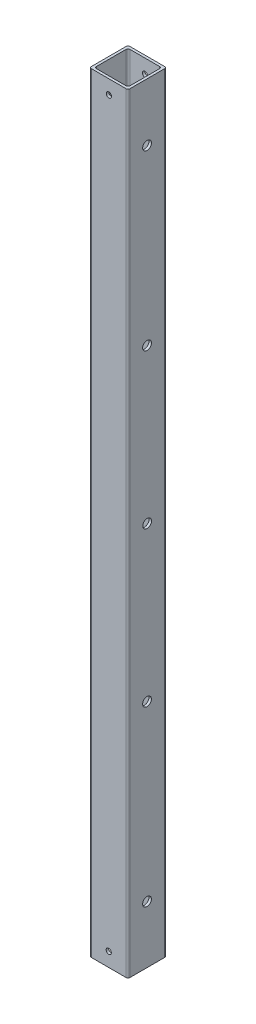
ISO-10303-21;
HEADER;
FILE_DESCRIPTION(('STEP AP214'),'2;1');
FILE_NAME('part.step','',(''),(''),'','','');
FILE_SCHEMA(('AUTOMOTIVE_DESIGN { 1 0 10303 214 1 1 1 1 }'));
ENDSEC;
DATA;
#1=APPLICATION_CONTEXT('core data for automotive mechanical design processes');
#2=APPLICATION_PROTOCOL_DEFINITION('international standard','automotive_design',2000,#1);
#3=PRODUCT_CONTEXT('',#1,'mechanical');
#4=PRODUCT('Part','Part','',(#3));
#5=PRODUCT_RELATED_PRODUCT_CATEGORY('part','',(#4));
#6=PRODUCT_DEFINITION_FORMATION('','',#4);
#7=PRODUCT_DEFINITION_CONTEXT('part definition',#1,'design');
#8=PRODUCT_DEFINITION('design','',#6,#7);
#9=PRODUCT_DEFINITION_SHAPE('','',#8);
#10=(LENGTH_UNIT() NAMED_UNIT(*) SI_UNIT(.MILLI.,.METRE.));
#11=(NAMED_UNIT(*) PLANE_ANGLE_UNIT() SI_UNIT($,.RADIAN.));
#12=(NAMED_UNIT(*) SI_UNIT($,.STERADIAN.) SOLID_ANGLE_UNIT());
#13=UNCERTAINTY_MEASURE_WITH_UNIT(LENGTH_MEASURE(1.E-05),#10,'distance_accuracy_value','');
#14=(GEOMETRIC_REPRESENTATION_CONTEXT(3) GLOBAL_UNCERTAINTY_ASSIGNED_CONTEXT((#13)) GLOBAL_UNIT_ASSIGNED_CONTEXT((#10,
#11,#12)) REPRESENTATION_CONTEXT('',''));
#15=CARTESIAN_POINT('',(0.,0.,0.));
#16=DIRECTION('',(0.,0.,1.));
#17=DIRECTION('',(1.,0.,0.));
#18=AXIS2_PLACEMENT_3D('',#15,#16,#17);
#19=CARTESIAN_POINT('',(0.,508.,0.));
#20=DIRECTION('',(0.,-1.,0.));
#21=DIRECTION('',(0.,0.,-1.));
#22=AXIS2_PLACEMENT_3D('',#19,#20,#21);
#23=PLANE('',#22);
#24=DIRECTION('',(0.,0.,1.));
#25=VECTOR('',#24,1.);
#26=CARTESIAN_POINT('',(-12.7,508.,12.7));
#27=LINE('',#26,#25);
#28=CARTESIAN_POINT('',(-12.7,508.,-11.43));
#29=VERTEX_POINT('',#28);
#30=CARTESIAN_POINT('',(-12.7,508.,11.43));
#31=VERTEX_POINT('',#30);
#32=EDGE_CURVE('E180',#29,#31,#27,.T.);
#33=ORIENTED_EDGE('',*,*,#32,.T.);
#34=CARTESIAN_POINT('',(-11.43,508.,11.43));
#35=DIRECTION('',(0.,-1.,0.));
#36=DIRECTION('',(0.,0.,-1.));
#37=AXIS2_PLACEMENT_3D('',#34,#35,#36);
#38=CIRCLE('',#37,1.27);
#39=CARTESIAN_POINT('',(-11.43,508.,12.7));
#40=VERTEX_POINT('',#39);
#41=EDGE_CURVE('E222',#31,#40,#38,.F.);
#42=ORIENTED_EDGE('',*,*,#41,.T.);
#43=DIRECTION('',(1.,0.,0.));
#44=VECTOR('',#43,1.);
#45=CARTESIAN_POINT('',(-12.7,508.,12.7));
#46=LINE('',#45,#44);
#47=CARTESIAN_POINT('',(11.43,508.,12.7));
#48=VERTEX_POINT('',#47);
#49=EDGE_CURVE('E175',#40,#48,#46,.T.);
#50=ORIENTED_EDGE('',*,*,#49,.T.);
#51=CARTESIAN_POINT('',(11.43,508.,11.43));
#52=DIRECTION('',(0.,-1.,0.));
#53=DIRECTION('',(0.,0.,-1.));
#54=AXIS2_PLACEMENT_3D('',#51,#52,#53);
#55=CIRCLE('',#54,1.27);
#56=CARTESIAN_POINT('',(12.7,508.,11.43));
#57=VERTEX_POINT('',#56);
#58=EDGE_CURVE('E217',#48,#57,#55,.F.);
#59=ORIENTED_EDGE('',*,*,#58,.T.);
#60=DIRECTION('',(0.,0.,-1.));
#61=VECTOR('',#60,1.);
#62=CARTESIAN_POINT('',(12.7,508.,12.7));
#63=LINE('',#62,#61);
#64=CARTESIAN_POINT('',(12.7,508.,-11.43));
#65=VERTEX_POINT('',#64);
#66=EDGE_CURVE('E337',#57,#65,#63,.T.);
#67=ORIENTED_EDGE('',*,*,#66,.T.);
#68=CARTESIAN_POINT('',(11.43,508.,-11.43));
#69=DIRECTION('',(0.,-1.,0.));
#70=DIRECTION('',(0.,0.,-1.));
#71=AXIS2_PLACEMENT_3D('',#68,#69,#70);
#72=CIRCLE('',#71,1.27);
#73=CARTESIAN_POINT('',(11.43,508.,-12.7));
#74=VERTEX_POINT('',#73);
#75=EDGE_CURVE('E58',#65,#74,#72,.F.);
#76=ORIENTED_EDGE('',*,*,#75,.T.);
#77=DIRECTION('',(-1.,0.,0.));
#78=VECTOR('',#77,1.);
#79=CARTESIAN_POINT('',(-12.7,508.,-12.7));
#80=LINE('',#79,#78);
#81=CARTESIAN_POINT('',(-11.43,508.,-12.7));
#82=VERTEX_POINT('',#81);
#83=EDGE_CURVE('E339',#74,#82,#80,.T.);
#84=ORIENTED_EDGE('',*,*,#83,.T.);
#85=CARTESIAN_POINT('',(-11.43,508.,-11.43));
#86=DIRECTION('',(0.,-1.,0.));
#87=DIRECTION('',(0.,0.,-1.));
#88=AXIS2_PLACEMENT_3D('',#85,#86,#87);
#89=CIRCLE('',#88,1.27);
#90=EDGE_CURVE('E220',#82,#29,#89,.F.);
#91=ORIENTED_EDGE('',*,*,#90,.T.);
#92=EDGE_LOOP('',(#33,#42,#50,#59,#67,#76,#84,#91));
#93=FACE_BOUND('',#92,.T.);
#94=DIRECTION('',(1.,0.,0.));
#95=VECTOR('',#94,1.);
#96=CARTESIAN_POINT('',(-11.049,508.,11.049));
#97=LINE('',#96,#95);
#98=CARTESIAN_POINT('',(-9.779,508.,11.049));
#99=VERTEX_POINT('',#98);
#100=CARTESIAN_POINT('',(9.779,508.,11.049));
#101=VERTEX_POINT('',#100);
#102=EDGE_CURVE('E320',#99,#101,#97,.T.);
#103=ORIENTED_EDGE('',*,*,#102,.F.);
#104=CARTESIAN_POINT('',(-9.779,508.,9.779));
#105=DIRECTION('',(0.,-1.,0.));
#106=DIRECTION('',(0.,0.,-1.));
#107=AXIS2_PLACEMENT_3D('',#104,#105,#106);
#108=CIRCLE('',#107,1.27);
#109=CARTESIAN_POINT('',(-11.049,508.,9.779));
#110=VERTEX_POINT('',#109);
#111=EDGE_CURVE('E11',#99,#110,#108,.T.);
#112=ORIENTED_EDGE('',*,*,#111,.T.);
#113=DIRECTION('',(0.,0.,1.));
#114=VECTOR('',#113,1.);
#115=CARTESIAN_POINT('',(-11.049,508.,11.049));
#116=LINE('',#115,#114);
#117=CARTESIAN_POINT('',(-11.049,508.,-9.779));
#118=VERTEX_POINT('',#117);
#119=EDGE_CURVE('E328',#118,#110,#116,.T.);
#120=ORIENTED_EDGE('',*,*,#119,.F.);
#121=CARTESIAN_POINT('',(-9.779,508.,-9.779));
#122=DIRECTION('',(0.,-1.,0.));
#123=DIRECTION('',(0.,0.,-1.));
#124=AXIS2_PLACEMENT_3D('',#121,#122,#123);
#125=CIRCLE('',#124,1.27);
#126=CARTESIAN_POINT('',(-9.779,508.,-11.049));
#127=VERTEX_POINT('',#126);
#128=EDGE_CURVE('E235',#118,#127,#125,.T.);
#129=ORIENTED_EDGE('',*,*,#128,.T.);
#130=DIRECTION('',(-1.,0.,0.));
#131=VECTOR('',#130,1.);
#132=CARTESIAN_POINT('',(-11.049,508.,-11.049));
#133=LINE('',#132,#131);
#134=CARTESIAN_POINT('',(9.779,508.,-11.049));
#135=VERTEX_POINT('',#134);
#136=EDGE_CURVE('E326',#135,#127,#133,.T.);
#137=ORIENTED_EDGE('',*,*,#136,.F.);
#138=CARTESIAN_POINT('',(9.779,508.,-9.779));
#139=DIRECTION('',(0.,-1.,0.));
#140=DIRECTION('',(0.,0.,-1.));
#141=AXIS2_PLACEMENT_3D('',#138,#139,#140);
#142=CIRCLE('',#141,1.27);
#143=CARTESIAN_POINT('',(11.049,508.,-9.779));
#144=VERTEX_POINT('',#143);
#145=EDGE_CURVE('E160',#135,#144,#142,.T.);
#146=ORIENTED_EDGE('',*,*,#145,.T.);
#147=DIRECTION('',(0.,0.,-1.));
#148=VECTOR('',#147,1.);
#149=CARTESIAN_POINT('',(11.049,508.,11.049));
#150=LINE('',#149,#148);
#151=CARTESIAN_POINT('',(11.049,508.,9.779));
#152=VERTEX_POINT('',#151);
#153=EDGE_CURVE('E323',#152,#144,#150,.T.);
#154=ORIENTED_EDGE('',*,*,#153,.F.);
#155=CARTESIAN_POINT('',(9.779,508.,9.779));
#156=DIRECTION('',(0.,-1.,0.));
#157=DIRECTION('',(0.,0.,-1.));
#158=AXIS2_PLACEMENT_3D('',#155,#156,#157);
#159=CIRCLE('',#158,1.27);
#160=EDGE_CURVE('E161',#152,#101,#159,.T.);
#161=ORIENTED_EDGE('',*,*,#160,.T.);
#162=EDGE_LOOP('',(#103,#112,#120,#129,#137,#146,#154,#161));
#163=FACE_BOUND('',#162,.T.);
#164=ADVANCED_FACE('F34',(#93,#163),#23,.F.);
#165=CARTESIAN_POINT('',(0.,0.,0.));
#166=DIRECTION('',(0.,-1.,0.));
#167=DIRECTION('',(0.,0.,-1.));
#168=AXIS2_PLACEMENT_3D('',#165,#166,#167);
#169=PLANE('',#168);
#170=DIRECTION('',(1.,0.,0.));
#171=VECTOR('',#170,1.);
#172=CARTESIAN_POINT('',(-12.7,0.,12.7));
#173=LINE('',#172,#171);
#174=CARTESIAN_POINT('',(-11.43,0.,12.7));
#175=VERTEX_POINT('',#174);
#176=CARTESIAN_POINT('',(11.43,0.,12.7));
#177=VERTEX_POINT('',#176);
#178=EDGE_CURVE('E183',#175,#177,#173,.T.);
#179=ORIENTED_EDGE('',*,*,#178,.F.);
#180=CARTESIAN_POINT('',(-11.43,0.,11.43));
#181=DIRECTION('',(0.,-1.,0.));
#182=DIRECTION('',(0.,0.,-1.));
#183=AXIS2_PLACEMENT_3D('',#180,#181,#182);
#184=CIRCLE('',#183,1.27);
#185=CARTESIAN_POINT('',(-12.7,0.,11.43));
#186=VERTEX_POINT('',#185);
#187=EDGE_CURVE('E210',#175,#186,#184,.T.);
#188=ORIENTED_EDGE('',*,*,#187,.T.);
#189=DIRECTION('',(0.,0.,1.));
#190=VECTOR('',#189,1.);
#191=CARTESIAN_POINT('',(-12.7,0.,12.7));
#192=LINE('',#191,#190);
#193=CARTESIAN_POINT('',(-12.7,0.,-11.43));
#194=VERTEX_POINT('',#193);
#195=EDGE_CURVE('E346',#194,#186,#192,.T.);
#196=ORIENTED_EDGE('',*,*,#195,.F.);
#197=CARTESIAN_POINT('',(-11.43,0.,-11.43));
#198=DIRECTION('',(0.,-1.,0.));
#199=DIRECTION('',(0.,0.,-1.));
#200=AXIS2_PLACEMENT_3D('',#197,#198,#199);
#201=CIRCLE('',#200,1.27);
#202=CARTESIAN_POINT('',(-11.43,0.,-12.7));
#203=VERTEX_POINT('',#202);
#204=EDGE_CURVE('E208',#194,#203,#201,.T.);
#205=ORIENTED_EDGE('',*,*,#204,.T.);
#206=DIRECTION('',(-1.,0.,0.));
#207=VECTOR('',#206,1.);
#208=CARTESIAN_POINT('',(-12.7,0.,-12.7));
#209=LINE('',#208,#207);
#210=CARTESIAN_POINT('',(11.43,0.,-12.7));
#211=VERTEX_POINT('',#210);
#212=EDGE_CURVE('E345',#211,#203,#209,.T.);
#213=ORIENTED_EDGE('',*,*,#212,.F.);
#214=CARTESIAN_POINT('',(11.43,0.,-11.43));
#215=DIRECTION('',(0.,-1.,0.));
#216=DIRECTION('',(0.,0.,-1.));
#217=AXIS2_PLACEMENT_3D('',#214,#215,#216);
#218=CIRCLE('',#217,1.27);
#219=CARTESIAN_POINT('',(12.7,0.,-11.43));
#220=VERTEX_POINT('',#219);
#221=EDGE_CURVE('E206',#211,#220,#218,.T.);
#222=ORIENTED_EDGE('',*,*,#221,.T.);
#223=DIRECTION('',(0.,0.,-1.));
#224=VECTOR('',#223,1.);
#225=CARTESIAN_POINT('',(12.7,0.,12.7));
#226=LINE('',#225,#224);
#227=CARTESIAN_POINT('',(12.7,0.,11.43));
#228=VERTEX_POINT('',#227);
#229=EDGE_CURVE('E331',#228,#220,#226,.T.);
#230=ORIENTED_EDGE('',*,*,#229,.F.);
#231=CARTESIAN_POINT('',(11.43,0.,11.43));
#232=DIRECTION('',(0.,-1.,0.));
#233=DIRECTION('',(0.,0.,-1.));
#234=AXIS2_PLACEMENT_3D('',#231,#232,#233);
#235=CIRCLE('',#234,1.27);
#236=EDGE_CURVE('E204',#228,#177,#235,.T.);
#237=ORIENTED_EDGE('',*,*,#236,.T.);
#238=EDGE_LOOP('',(#179,#188,#196,#205,#213,#222,#230,#237));
#239=FACE_BOUND('',#238,.T.);
#240=DIRECTION('',(-1.,0.,0.));
#241=VECTOR('',#240,1.);
#242=CARTESIAN_POINT('',(-11.049,0.,-11.049));
#243=LINE('',#242,#241);
#244=CARTESIAN_POINT('',(9.779,0.,-11.049));
#245=VERTEX_POINT('',#244);
#246=CARTESIAN_POINT('',(-9.779,0.,-11.049));
#247=VERTEX_POINT('',#246);
#248=EDGE_CURVE('E153',#245,#247,#243,.T.);
#249=ORIENTED_EDGE('',*,*,#248,.T.);
#250=CARTESIAN_POINT('',(-9.779,0.,-9.779));
#251=DIRECTION('',(0.,-1.,0.));
#252=DIRECTION('',(0.,0.,-1.));
#253=AXIS2_PLACEMENT_3D('',#250,#251,#252);
#254=CIRCLE('',#253,1.27);
#255=CARTESIAN_POINT('',(-11.049,0.,-9.779));
#256=VERTEX_POINT('',#255);
#257=EDGE_CURVE('E233',#247,#256,#254,.F.);
#258=ORIENTED_EDGE('',*,*,#257,.T.);
#259=DIRECTION('',(0.,0.,1.));
#260=VECTOR('',#259,1.);
#261=CARTESIAN_POINT('',(-11.049,0.,11.049));
#262=LINE('',#261,#260);
#263=CARTESIAN_POINT('',(-11.049,0.,9.779));
#264=VERTEX_POINT('',#263);
#265=EDGE_CURVE('E171',#256,#264,#262,.T.);
#266=ORIENTED_EDGE('',*,*,#265,.T.);
#267=CARTESIAN_POINT('',(-9.779,0.,9.779));
#268=DIRECTION('',(0.,-1.,0.));
#269=DIRECTION('',(0.,0.,-1.));
#270=AXIS2_PLACEMENT_3D('',#267,#268,#269);
#271=CIRCLE('',#270,1.27);
#272=CARTESIAN_POINT('',(-9.779,0.,11.049));
#273=VERTEX_POINT('',#272);
#274=EDGE_CURVE('E43',#264,#273,#271,.F.);
#275=ORIENTED_EDGE('',*,*,#274,.T.);
#276=DIRECTION('',(1.,0.,0.));
#277=VECTOR('',#276,1.);
#278=CARTESIAN_POINT('',(-11.049,0.,11.049));
#279=LINE('',#278,#277);
#280=CARTESIAN_POINT('',(9.779,0.,11.049));
#281=VERTEX_POINT('',#280);
#282=EDGE_CURVE('E319',#273,#281,#279,.T.);
#283=ORIENTED_EDGE('',*,*,#282,.T.);
#284=CARTESIAN_POINT('',(9.779,0.,9.779));
#285=DIRECTION('',(0.,-1.,0.));
#286=DIRECTION('',(0.,0.,-1.));
#287=AXIS2_PLACEMENT_3D('',#284,#285,#286);
#288=CIRCLE('',#287,1.27);
#289=CARTESIAN_POINT('',(11.049,0.,9.779));
#290=VERTEX_POINT('',#289);
#291=EDGE_CURVE('E237',#281,#290,#288,.F.);
#292=ORIENTED_EDGE('',*,*,#291,.T.);
#293=DIRECTION('',(0.,0.,-1.));
#294=VECTOR('',#293,1.);
#295=CARTESIAN_POINT('',(11.049,0.,11.049));
#296=LINE('',#295,#294);
#297=CARTESIAN_POINT('',(11.049,0.,-9.779));
#298=VERTEX_POINT('',#297);
#299=EDGE_CURVE('E155',#290,#298,#296,.T.);
#300=ORIENTED_EDGE('',*,*,#299,.T.);
#301=CARTESIAN_POINT('',(9.779,0.,-9.779));
#302=DIRECTION('',(0.,-1.,0.));
#303=DIRECTION('',(0.,0.,-1.));
#304=AXIS2_PLACEMENT_3D('',#301,#302,#303);
#305=CIRCLE('',#304,1.27);
#306=EDGE_CURVE('E150',#298,#245,#305,.F.);
#307=ORIENTED_EDGE('',*,*,#306,.T.);
#308=EDGE_LOOP('',(#249,#258,#266,#275,#283,#292,#300,#307));
#309=FACE_BOUND('',#308,.T.);
#310=ADVANCED_FACE('F152',(#239,#309),#169,.T.);
#311=CARTESIAN_POINT('',(12.7,508.,12.7));
#312=DIRECTION('',(-1.,0.,0.));
#313=DIRECTION('',(0.,0.,1.));
#314=AXIS2_PLACEMENT_3D('',#311,#312,#313);
#315=PLANE('',#314);
#316=CARTESIAN_POINT('',(12.7,469.9,0.152399999999886));
#317=DIRECTION('',(-1.,0.,0.));
#318=DIRECTION('',(0.,0.,1.));
#319=AXIS2_PLACEMENT_3D('',#316,#317,#318);
#320=CIRCLE('',#319,2.8956);
#321=CARTESIAN_POINT('',(12.7,469.9,3.04799999999988));
#322=VERTEX_POINT('',#321);
#323=EDGE_CURVE('E260',#322,#322,#320,.T.);
#324=ORIENTED_EDGE('',*,*,#323,.T.);
#325=EDGE_LOOP('',(#324));
#326=FACE_BOUND('',#325,.T.);
#327=CARTESIAN_POINT('',(12.7,355.6,0.152399999999941));
#328=DIRECTION('',(-1.,0.,0.));
#329=DIRECTION('',(0.,0.,1.));
#330=AXIS2_PLACEMENT_3D('',#327,#328,#329);
#331=CIRCLE('',#330,2.8956);
#332=CARTESIAN_POINT('',(12.7,355.6,3.04799999999994));
#333=VERTEX_POINT('',#332);
#334=EDGE_CURVE('E289',#333,#333,#331,.T.);
#335=ORIENTED_EDGE('',*,*,#334,.T.);
#336=EDGE_LOOP('',(#335));
#337=FACE_BOUND('',#336,.T.);
#338=CARTESIAN_POINT('',(12.7,253.8476,0.0761999999998042));
#339=DIRECTION('',(-1.,0.,0.));
#340=DIRECTION('',(0.,0.,1.));
#341=AXIS2_PLACEMENT_3D('',#338,#339,#340);
#342=CIRCLE('',#341,2.8956);
#343=CARTESIAN_POINT('',(12.7,253.8476,2.9717999999998));
#344=VERTEX_POINT('',#343);
#345=EDGE_CURVE('E256',#344,#344,#342,.T.);
#346=ORIENTED_EDGE('',*,*,#345,.T.);
#347=EDGE_LOOP('',(#346));
#348=FACE_BOUND('',#347,.T.);
#349=CARTESIAN_POINT('',(12.7,152.0952,0.152400000000108));
#350=DIRECTION('',(-1.,0.,0.));
#351=DIRECTION('',(0.,0.,1.));
#352=AXIS2_PLACEMENT_3D('',#349,#350,#351);
#353=CIRCLE('',#352,2.8956);
#354=CARTESIAN_POINT('',(12.7,152.0952,3.04800000000011));
#355=VERTEX_POINT('',#354);
#356=EDGE_CURVE('E251',#355,#355,#353,.T.);
#357=ORIENTED_EDGE('',*,*,#356,.T.);
#358=EDGE_LOOP('',(#357));
#359=FACE_BOUND('',#358,.T.);
#360=CARTESIAN_POINT('',(12.7,37.7951999999999,0.152399999999886));
#361=DIRECTION('',(-1.,0.,0.));
#362=DIRECTION('',(0.,0.,1.));
#363=AXIS2_PLACEMENT_3D('',#360,#361,#362);
#364=CIRCLE('',#363,2.8956);
#365=CARTESIAN_POINT('',(12.7,37.7951999999999,3.04799999999988));
#366=VERTEX_POINT('',#365);
#367=EDGE_CURVE('E246',#366,#366,#364,.T.);
#368=ORIENTED_EDGE('',*,*,#367,.T.);
#369=EDGE_LOOP('',(#368));
#370=FACE_BOUND('',#369,.T.);
#371=ORIENTED_EDGE('',*,*,#229,.T.);
#372=DIRECTION('',(0.,-1.,0.));
#373=VECTOR('',#372,1.);
#374=CARTESIAN_POINT('',(12.7,508.,-11.43));
#375=LINE('',#374,#373);
#376=EDGE_CURVE('E231',#220,#65,#375,.F.);
#377=ORIENTED_EDGE('',*,*,#376,.T.);
#378=ORIENTED_EDGE('',*,*,#66,.F.);
#379=DIRECTION('',(0.,-1.,0.));
#380=VECTOR('',#379,1.);
#381=CARTESIAN_POINT('',(12.7,508.,11.43));
#382=LINE('',#381,#380);
#383=EDGE_CURVE('E228',#57,#228,#382,.T.);
#384=ORIENTED_EDGE('',*,*,#383,.T.);
#385=EDGE_LOOP('',(#371,#377,#378,#384));
#386=FACE_BOUND('',#385,.T.);
#387=ADVANCED_FACE('F365',(#326,#337,#348,#359,#370,#386),#315,.F.);
#388=CARTESIAN_POINT('',(-12.7,508.,-12.7));
#389=DIRECTION('',(0.,0.,1.));
#390=DIRECTION('',(1.,0.,0.));
#391=AXIS2_PLACEMENT_3D('',#388,#389,#390);
#392=PLANE('',#391);
#393=CARTESIAN_POINT('',(0.,9.271,-12.7));
#394=DIRECTION('',(0.,0.,1.));
#395=DIRECTION('',(1.,0.,0.));
#396=AXIS2_PLACEMENT_3D('',#393,#394,#395);
#397=CIRCLE('',#396,1.72719999999999);
#398=CARTESIAN_POINT('',(1.72720000000006,9.271,-12.7));
#399=VERTEX_POINT('',#398);
#400=EDGE_CURVE('E785',#399,#399,#397,.T.);
#401=ORIENTED_EDGE('',*,*,#400,.T.);
#402=EDGE_LOOP('',(#401));
#403=FACE_BOUND('',#402,.T.);
#404=CARTESIAN_POINT('',(0.103095801553498,498.728999999999,-12.7));
#405=DIRECTION('',(0.,0.,1.));
#406=DIRECTION('',(1.,0.,0.));
#407=AXIS2_PLACEMENT_3D('',#404,#405,#406);
#408=CIRCLE('',#407,1.72719999999999);
#409=CARTESIAN_POINT('',(1.83029580155349,498.728999999999,-12.7));
#410=VERTEX_POINT('',#409);
#411=EDGE_CURVE('E264',#410,#410,#408,.T.);
#412=ORIENTED_EDGE('',*,*,#411,.T.);
#413=EDGE_LOOP('',(#412));
#414=FACE_BOUND('',#413,.T.);
#415=ORIENTED_EDGE('',*,*,#212,.T.);
#416=DIRECTION('',(0.,-1.,0.));
#417=VECTOR('',#416,1.);
#418=CARTESIAN_POINT('',(-11.43,508.,-12.7));
#419=LINE('',#418,#417);
#420=EDGE_CURVE('E51',#203,#82,#419,.F.);
#421=ORIENTED_EDGE('',*,*,#420,.T.);
#422=ORIENTED_EDGE('',*,*,#83,.F.);
#423=DIRECTION('',(0.,-1.,0.));
#424=VECTOR('',#423,1.);
#425=CARTESIAN_POINT('',(11.43,508.,-12.7));
#426=LINE('',#425,#424);
#427=EDGE_CURVE('E224',#74,#211,#426,.T.);
#428=ORIENTED_EDGE('',*,*,#427,.T.);
#429=EDGE_LOOP('',(#415,#421,#422,#428));
#430=FACE_BOUND('',#429,.T.);
#431=ADVANCED_FACE('F372',(#403,#414,#430),#392,.F.);
#432=CARTESIAN_POINT('',(-12.7,508.,12.7));
#433=DIRECTION('',(1.,0.,0.));
#434=DIRECTION('',(0.,0.,-1.));
#435=AXIS2_PLACEMENT_3D('',#432,#433,#434);
#436=PLANE('',#435);
#437=CARTESIAN_POINT('',(-12.7,469.9,0.152399999999886));
#438=DIRECTION('',(-1.,0.,0.));
#439=DIRECTION('',(0.,0.,1.));
#440=AXIS2_PLACEMENT_3D('',#437,#438,#439);
#441=CIRCLE('',#440,2.8956);
#442=CARTESIAN_POINT('',(-12.7,469.9,3.04799999999988));
#443=VERTEX_POINT('',#442);
#444=EDGE_CURVE('E268',#443,#443,#441,.T.);
#445=ORIENTED_EDGE('',*,*,#444,.F.);
#446=EDGE_LOOP('',(#445));
#447=FACE_BOUND('',#446,.T.);
#448=CARTESIAN_POINT('',(-12.7,355.6,0.152399999999941));
#449=DIRECTION('',(-1.,0.,0.));
#450=DIRECTION('',(0.,0.,1.));
#451=AXIS2_PLACEMENT_3D('',#448,#449,#450);
#452=CIRCLE('',#451,2.8956);
#453=CARTESIAN_POINT('',(-12.7,355.6,3.04799999999994));
#454=VERTEX_POINT('',#453);
#455=EDGE_CURVE('E286',#454,#454,#452,.T.);
#456=ORIENTED_EDGE('',*,*,#455,.F.);
#457=EDGE_LOOP('',(#456));
#458=FACE_BOUND('',#457,.T.);
#459=CARTESIAN_POINT('',(-12.7,253.8476,0.0761999999998042));
#460=DIRECTION('',(-1.,0.,0.));
#461=DIRECTION('',(0.,0.,1.));
#462=AXIS2_PLACEMENT_3D('',#459,#460,#461);
#463=CIRCLE('',#462,2.8956);
#464=CARTESIAN_POINT('',(-12.7,253.8476,2.9717999999998));
#465=VERTEX_POINT('',#464);
#466=EDGE_CURVE('E298',#465,#465,#463,.T.);
#467=ORIENTED_EDGE('',*,*,#466,.F.);
#468=EDGE_LOOP('',(#467));
#469=FACE_BOUND('',#468,.T.);
#470=CARTESIAN_POINT('',(-12.7,152.0952,0.152400000000108));
#471=DIRECTION('',(-1.,0.,0.));
#472=DIRECTION('',(0.,0.,1.));
#473=AXIS2_PLACEMENT_3D('',#470,#471,#472);
#474=CIRCLE('',#473,2.8956);
#475=CARTESIAN_POINT('',(-12.7,152.0952,3.04800000000011));
#476=VERTEX_POINT('',#475);
#477=EDGE_CURVE('E305',#476,#476,#474,.T.);
#478=ORIENTED_EDGE('',*,*,#477,.F.);
#479=EDGE_LOOP('',(#478));
#480=FACE_BOUND('',#479,.T.);
#481=CARTESIAN_POINT('',(-12.7,37.7951999999999,0.152399999999886));
#482=DIRECTION('',(-1.,0.,0.));
#483=DIRECTION('',(0.,0.,1.));
#484=AXIS2_PLACEMENT_3D('',#481,#482,#483);
#485=CIRCLE('',#484,2.89559999999998);
#486=CARTESIAN_POINT('',(-12.7,37.7951999999999,3.04799999999987));
#487=VERTEX_POINT('',#486);
#488=EDGE_CURVE('E312',#487,#487,#485,.T.);
#489=ORIENTED_EDGE('',*,*,#488,.F.);
#490=EDGE_LOOP('',(#489));
#491=FACE_BOUND('',#490,.T.);
#492=ORIENTED_EDGE('',*,*,#195,.T.);
#493=DIRECTION('',(0.,-1.,0.));
#494=VECTOR('',#493,1.);
#495=CARTESIAN_POINT('',(-12.7,508.,11.43));
#496=LINE('',#495,#494);
#497=EDGE_CURVE('E215',#186,#31,#496,.F.);
#498=ORIENTED_EDGE('',*,*,#497,.T.);
#499=ORIENTED_EDGE('',*,*,#32,.F.);
#500=DIRECTION('',(0.,-1.,0.));
#501=VECTOR('',#500,1.);
#502=CARTESIAN_POINT('',(-12.7,508.,-11.43));
#503=LINE('',#502,#501);
#504=EDGE_CURVE('E212',#29,#194,#503,.T.);
#505=ORIENTED_EDGE('',*,*,#504,.T.);
#506=EDGE_LOOP('',(#492,#498,#499,#505));
#507=FACE_BOUND('',#506,.T.);
#508=ADVANCED_FACE('F378',(#447,#458,#469,#480,#491,#507),#436,.F.);
#509=CARTESIAN_POINT('',(-12.7,508.,12.7));
#510=DIRECTION('',(0.,0.,-1.));
#511=DIRECTION('',(-1.,0.,0.));
#512=AXIS2_PLACEMENT_3D('',#509,#510,#511);
#513=PLANE('',#512);
#514=CARTESIAN_POINT('',(0.,9.271,12.7));
#515=DIRECTION('',(0.,0.,1.));
#516=DIRECTION('',(1.,0.,0.));
#517=AXIS2_PLACEMENT_3D('',#514,#515,#516);
#518=CIRCLE('',#517,1.7272);
#519=CARTESIAN_POINT('',(1.72720000000006,9.271,12.7));
#520=VERTEX_POINT('',#519);
#521=EDGE_CURVE('E789',#520,#520,#518,.T.);
#522=ORIENTED_EDGE('',*,*,#521,.F.);
#523=EDGE_LOOP('',(#522));
#524=FACE_BOUND('',#523,.T.);
#525=CARTESIAN_POINT('',(0.103095801553498,498.728999999999,12.7));
#526=DIRECTION('',(0.,0.,1.));
#527=DIRECTION('',(1.,0.,0.));
#528=AXIS2_PLACEMENT_3D('',#525,#526,#527);
#529=CIRCLE('',#528,1.7272);
#530=CARTESIAN_POINT('',(1.8302958015535,498.728999999999,12.7));
#531=VERTEX_POINT('',#530);
#532=EDGE_CURVE('E271',#531,#531,#529,.T.);
#533=ORIENTED_EDGE('',*,*,#532,.F.);
#534=EDGE_LOOP('',(#533));
#535=FACE_BOUND('',#534,.T.);
#536=ORIENTED_EDGE('',*,*,#49,.F.);
#537=DIRECTION('',(0.,-1.,0.));
#538=VECTOR('',#537,1.);
#539=CARTESIAN_POINT('',(-11.43,508.,12.7));
#540=LINE('',#539,#538);
#541=EDGE_CURVE('E201',#40,#175,#540,.T.);
#542=ORIENTED_EDGE('',*,*,#541,.T.);
#543=ORIENTED_EDGE('',*,*,#178,.T.);
#544=DIRECTION('',(0.,-1.,0.));
#545=VECTOR('',#544,1.);
#546=CARTESIAN_POINT('',(11.43,508.,12.7));
#547=LINE('',#546,#545);
#548=EDGE_CURVE('E199',#177,#48,#547,.F.);
#549=ORIENTED_EDGE('',*,*,#548,.T.);
#550=EDGE_LOOP('',(#536,#542,#543,#549));
#551=FACE_BOUND('',#550,.T.);
#552=ADVANCED_FACE('F356',(#524,#535,#551),#513,.F.);
#553=CARTESIAN_POINT('',(-11.049,508.,11.049));
#554=DIRECTION('',(0.,0.,-1.));
#555=DIRECTION('',(-1.,0.,0.));
#556=AXIS2_PLACEMENT_3D('',#553,#554,#555);
#557=PLANE('',#556);
#558=CARTESIAN_POINT('',(0.,9.271,11.049));
#559=DIRECTION('',(0.,0.,-1.));
#560=DIRECTION('',(-1.,0.,0.));
#561=AXIS2_PLACEMENT_3D('',#558,#559,#560);
#562=CIRCLE('',#561,1.7272);
#563=CARTESIAN_POINT('',(-1.72719999999993,9.271,11.049));
#564=VERTEX_POINT('',#563);
#565=EDGE_CURVE('E276',#564,#564,#562,.T.);
#566=ORIENTED_EDGE('',*,*,#565,.F.);
#567=EDGE_LOOP('',(#566));
#568=FACE_BOUND('',#567,.T.);
#569=CARTESIAN_POINT('',(0.103095801553498,498.728999999999,11.049));
#570=DIRECTION('',(0.,0.,-1.));
#571=DIRECTION('',(-1.,0.,0.));
#572=AXIS2_PLACEMENT_3D('',#569,#570,#571);
#573=CIRCLE('',#572,1.7272);
#574=CARTESIAN_POINT('',(-1.6241041984465,498.728999999999,11.049));
#575=VERTEX_POINT('',#574);
#576=EDGE_CURVE('E263',#575,#575,#573,.T.);
#577=ORIENTED_EDGE('',*,*,#576,.F.);
#578=EDGE_LOOP('',(#577));
#579=FACE_BOUND('',#578,.T.);
#580=ORIENTED_EDGE('',*,*,#102,.T.);
#581=DIRECTION('',(0.,-1.,0.));
#582=VECTOR('',#581,1.);
#583=CARTESIAN_POINT('',(9.779,0.,11.049));
#584=LINE('',#583,#582);
#585=EDGE_CURVE('E192',#101,#281,#584,.T.);
#586=ORIENTED_EDGE('',*,*,#585,.T.);
#587=ORIENTED_EDGE('',*,*,#282,.F.);
#588=DIRECTION('',(0.,-1.,0.));
#589=VECTOR('',#588,1.);
#590=CARTESIAN_POINT('',(-9.779,508.,11.049));
#591=LINE('',#590,#589);
#592=EDGE_CURVE('E190',#273,#99,#591,.F.);
#593=ORIENTED_EDGE('',*,*,#592,.T.);
#594=EDGE_LOOP('',(#580,#586,#587,#593));
#595=FACE_BOUND('',#594,.T.);
#596=ADVANCED_FACE('F399',(#568,#579,#595),#557,.T.);
#597=CARTESIAN_POINT('',(11.049,508.,11.049));
#598=DIRECTION('',(-1.,0.,0.));
#599=DIRECTION('',(0.,0.,1.));
#600=AXIS2_PLACEMENT_3D('',#597,#598,#599);
#601=PLANE('',#600);
#602=CARTESIAN_POINT('',(11.049,469.9,0.152399999999886));
#603=DIRECTION('',(-1.,0.,0.));
#604=DIRECTION('',(0.,0.,1.));
#605=AXIS2_PLACEMENT_3D('',#602,#603,#604);
#606=CIRCLE('',#605,2.8956);
#607=CARTESIAN_POINT('',(11.049,469.9,3.04799999999988));
#608=VERTEX_POINT('',#607);
#609=EDGE_CURVE('E259',#608,#608,#606,.T.);
#610=ORIENTED_EDGE('',*,*,#609,.F.);
#611=EDGE_LOOP('',(#610));
#612=FACE_BOUND('',#611,.T.);
#613=CARTESIAN_POINT('',(11.049,355.6,0.152399999999941));
#614=DIRECTION('',(-1.,0.,0.));
#615=DIRECTION('',(0.,0.,1.));
#616=AXIS2_PLACEMENT_3D('',#613,#614,#615);
#617=CIRCLE('',#616,2.8956);
#618=CARTESIAN_POINT('',(11.049,355.6,3.04799999999994));
#619=VERTEX_POINT('',#618);
#620=EDGE_CURVE('E292',#619,#619,#617,.T.);
#621=ORIENTED_EDGE('',*,*,#620,.F.);
#622=EDGE_LOOP('',(#621));
#623=FACE_BOUND('',#622,.T.);
#624=CARTESIAN_POINT('',(11.049,253.8476,0.0761999999998042));
#625=DIRECTION('',(-1.,0.,0.));
#626=DIRECTION('',(0.,0.,1.));
#627=AXIS2_PLACEMENT_3D('',#624,#625,#626);
#628=CIRCLE('',#627,2.8956);
#629=CARTESIAN_POINT('',(11.049,253.8476,2.9717999999998));
#630=VERTEX_POINT('',#629);
#631=EDGE_CURVE('E255',#630,#630,#628,.T.);
#632=ORIENTED_EDGE('',*,*,#631,.F.);
#633=EDGE_LOOP('',(#632));
#634=FACE_BOUND('',#633,.T.);
#635=CARTESIAN_POINT('',(11.049,152.0952,0.152400000000108));
#636=DIRECTION('',(-1.,0.,0.));
#637=DIRECTION('',(0.,0.,1.));
#638=AXIS2_PLACEMENT_3D('',#635,#636,#637);
#639=CIRCLE('',#638,2.8956);
#640=CARTESIAN_POINT('',(11.049,152.0952,3.04800000000011));
#641=VERTEX_POINT('',#640);
#642=EDGE_CURVE('E250',#641,#641,#639,.T.);
#643=ORIENTED_EDGE('',*,*,#642,.F.);
#644=EDGE_LOOP('',(#643));
#645=FACE_BOUND('',#644,.T.);
#646=CARTESIAN_POINT('',(11.049,37.7951999999999,0.152399999999886));
#647=DIRECTION('',(-1.,0.,0.));
#648=DIRECTION('',(0.,0.,1.));
#649=AXIS2_PLACEMENT_3D('',#646,#647,#648);
#650=CIRCLE('',#649,2.89559999999999);
#651=CARTESIAN_POINT('',(11.049,37.7951999999999,3.04799999999988));
#652=VERTEX_POINT('',#651);
#653=EDGE_CURVE('E245',#652,#652,#650,.T.);
#654=ORIENTED_EDGE('',*,*,#653,.F.);
#655=EDGE_LOOP('',(#654));
#656=FACE_BOUND('',#655,.T.);
#657=ORIENTED_EDGE('',*,*,#299,.F.);
#658=DIRECTION('',(0.,-1.,0.));
#659=VECTOR('',#658,1.);
#660=CARTESIAN_POINT('',(11.049,508.,9.779));
#661=LINE('',#660,#659);
#662=EDGE_CURVE('E197',#290,#152,#661,.F.);
#663=ORIENTED_EDGE('',*,*,#662,.T.);
#664=ORIENTED_EDGE('',*,*,#153,.T.);
#665=DIRECTION('',(0.,-1.,0.));
#666=VECTOR('',#665,1.);
#667=CARTESIAN_POINT('',(11.049,0.,-9.779));
#668=LINE('',#667,#666);
#669=EDGE_CURVE('E195',#144,#298,#668,.T.);
#670=ORIENTED_EDGE('',*,*,#669,.T.);
#671=EDGE_LOOP('',(#657,#663,#664,#670));
#672=FACE_BOUND('',#671,.T.);
#673=ADVANCED_FACE('F512',(#612,#623,#634,#645,#656,#672),#601,.T.);
#674=CARTESIAN_POINT('',(-11.049,508.,-11.049));
#675=DIRECTION('',(0.,0.,1.));
#676=DIRECTION('',(1.,0.,0.));
#677=AXIS2_PLACEMENT_3D('',#674,#675,#676);
#678=PLANE('',#677);
#679=CARTESIAN_POINT('',(0.,9.271,-11.049));
#680=DIRECTION('',(0.,0.,1.));
#681=DIRECTION('',(1.,0.,0.));
#682=AXIS2_PLACEMENT_3D('',#679,#680,#681);
#683=CIRCLE('',#682,1.7272);
#684=CARTESIAN_POINT('',(1.72720000000006,9.271,-11.049));
#685=VERTEX_POINT('',#684);
#686=EDGE_CURVE('E38',#685,#685,#683,.T.);
#687=ORIENTED_EDGE('',*,*,#686,.F.);
#688=EDGE_LOOP('',(#687));
#689=FACE_BOUND('',#688,.T.);
#690=CARTESIAN_POINT('',(0.103095801553498,498.728999999999,-11.049));
#691=DIRECTION('',(0.,0.,1.));
#692=DIRECTION('',(1.,0.,0.));
#693=AXIS2_PLACEMENT_3D('',#690,#691,#692);
#694=CIRCLE('',#693,1.7272);
#695=CARTESIAN_POINT('',(1.83029580155349,498.728999999999,-11.049));
#696=VERTEX_POINT('',#695);
#697=EDGE_CURVE('E261',#696,#696,#694,.T.);
#698=ORIENTED_EDGE('',*,*,#697,.F.);
#699=EDGE_LOOP('',(#698));
#700=FACE_BOUND('',#699,.T.);
#701=ORIENTED_EDGE('',*,*,#136,.T.);
#702=DIRECTION('',(0.,-1.,0.));
#703=VECTOR('',#702,1.);
#704=CARTESIAN_POINT('',(-9.779,0.,-11.049));
#705=LINE('',#704,#703);
#706=EDGE_CURVE('E170',#127,#247,#705,.T.);
#707=ORIENTED_EDGE('',*,*,#706,.T.);
#708=ORIENTED_EDGE('',*,*,#248,.F.);
#709=DIRECTION('',(0.,-1.,0.));
#710=VECTOR('',#709,1.);
#711=CARTESIAN_POINT('',(9.779,508.,-11.049));
#712=LINE('',#711,#710);
#713=EDGE_CURVE('E167',#245,#135,#712,.F.);
#714=ORIENTED_EDGE('',*,*,#713,.T.);
#715=EDGE_LOOP('',(#701,#707,#708,#714));
#716=FACE_BOUND('',#715,.T.);
#717=ADVANCED_FACE('F166',(#689,#700,#716),#678,.T.);
#718=CARTESIAN_POINT('',(-11.049,508.,11.049));
#719=DIRECTION('',(1.,0.,0.));
#720=DIRECTION('',(0.,0.,-1.));
#721=AXIS2_PLACEMENT_3D('',#718,#719,#720);
#722=PLANE('',#721);
#723=CARTESIAN_POINT('',(-11.049,469.9,0.152399999999886));
#724=DIRECTION('',(1.,0.,0.));
#725=DIRECTION('',(0.,0.,-1.));
#726=AXIS2_PLACEMENT_3D('',#723,#724,#725);
#727=CIRCLE('',#726,2.8956);
#728=CARTESIAN_POINT('',(-11.049,469.9,-2.74320000000011));
#729=VERTEX_POINT('',#728);
#730=EDGE_CURVE('E257',#729,#729,#727,.T.);
#731=ORIENTED_EDGE('',*,*,#730,.F.);
#732=EDGE_LOOP('',(#731));
#733=FACE_BOUND('',#732,.T.);
#734=CARTESIAN_POINT('',(-11.049,355.6,0.152399999999941));
#735=DIRECTION('',(1.,0.,0.));
#736=DIRECTION('',(0.,0.,-1.));
#737=AXIS2_PLACEMENT_3D('',#734,#735,#736);
#738=CIRCLE('',#737,2.8956);
#739=CARTESIAN_POINT('',(-11.049,355.6,-2.74320000000006));
#740=VERTEX_POINT('',#739);
#741=EDGE_CURVE('E295',#740,#740,#738,.T.);
#742=ORIENTED_EDGE('',*,*,#741,.F.);
#743=EDGE_LOOP('',(#742));
#744=FACE_BOUND('',#743,.T.);
#745=CARTESIAN_POINT('',(-11.049,253.8476,0.0761999999998042));
#746=DIRECTION('',(1.,0.,0.));
#747=DIRECTION('',(0.,0.,-1.));
#748=AXIS2_PLACEMENT_3D('',#745,#746,#747);
#749=CIRCLE('',#748,2.8956);
#750=CARTESIAN_POINT('',(-11.049,253.8476,-2.81940000000019));
#751=VERTEX_POINT('',#750);
#752=EDGE_CURVE('E252',#751,#751,#749,.T.);
#753=ORIENTED_EDGE('',*,*,#752,.F.);
#754=EDGE_LOOP('',(#753));
#755=FACE_BOUND('',#754,.T.);
#756=CARTESIAN_POINT('',(-11.049,152.0952,0.152400000000108));
#757=DIRECTION('',(1.,0.,0.));
#758=DIRECTION('',(0.,0.,-1.));
#759=AXIS2_PLACEMENT_3D('',#756,#757,#758);
#760=CIRCLE('',#759,2.8956);
#761=CARTESIAN_POINT('',(-11.049,152.0952,-2.74319999999989));
#762=VERTEX_POINT('',#761);
#763=EDGE_CURVE('E247',#762,#762,#760,.T.);
#764=ORIENTED_EDGE('',*,*,#763,.F.);
#765=EDGE_LOOP('',(#764));
#766=FACE_BOUND('',#765,.T.);
#767=CARTESIAN_POINT('',(-11.049,37.7951999999999,0.152399999999886));
#768=DIRECTION('',(1.,0.,0.));
#769=DIRECTION('',(0.,0.,-1.));
#770=AXIS2_PLACEMENT_3D('',#767,#768,#769);
#771=CIRCLE('',#770,2.89559999999999);
#772=CARTESIAN_POINT('',(-11.049,37.7951999999999,-2.74320000000011));
#773=VERTEX_POINT('',#772);
#774=EDGE_CURVE('E242',#773,#773,#771,.T.);
#775=ORIENTED_EDGE('',*,*,#774,.F.);
#776=EDGE_LOOP('',(#775));
#777=FACE_BOUND('',#776,.T.);
#778=ORIENTED_EDGE('',*,*,#265,.F.);
#779=DIRECTION('',(0.,-1.,0.));
#780=VECTOR('',#779,1.);
#781=CARTESIAN_POINT('',(-11.049,508.,-9.779));
#782=LINE('',#781,#780);
#783=EDGE_CURVE('E188',#256,#118,#782,.F.);
#784=ORIENTED_EDGE('',*,*,#783,.T.);
#785=ORIENTED_EDGE('',*,*,#119,.T.);
#786=DIRECTION('',(0.,-1.,0.));
#787=VECTOR('',#786,1.);
#788=CARTESIAN_POINT('',(-11.049,0.,9.779));
#789=LINE('',#788,#787);
#790=EDGE_CURVE('E177',#110,#264,#789,.T.);
#791=ORIENTED_EDGE('',*,*,#790,.T.);
#792=EDGE_LOOP('',(#778,#784,#785,#791));
#793=FACE_BOUND('',#792,.T.);
#794=ADVANCED_FACE('F418',(#733,#744,#755,#766,#777,#793),#722,.T.);
#795=CARTESIAN_POINT('',(-9.779,508.,-9.779));
#796=DIRECTION('',(0.,1.,0.));
#797=DIRECTION('',(0.,0.,1.));
#798=AXIS2_PLACEMENT_3D('',#795,#796,#797);
#799=CYLINDRICAL_SURFACE('',#798,1.27);
#800=ORIENTED_EDGE('',*,*,#128,.F.);
#801=ORIENTED_EDGE('',*,*,#783,.F.);
#802=ORIENTED_EDGE('',*,*,#257,.F.);
#803=ORIENTED_EDGE('',*,*,#706,.F.);
#804=EDGE_LOOP('',(#800,#801,#802,#803));
#805=FACE_BOUND('',#804,.T.);
#806=ADVANCED_FACE('F414',(#805),#799,.F.);
#807=CARTESIAN_POINT('',(9.779,508.,9.779));
#808=DIRECTION('',(0.,1.,0.));
#809=DIRECTION('',(0.,0.,1.));
#810=AXIS2_PLACEMENT_3D('',#807,#808,#809);
#811=CYLINDRICAL_SURFACE('',#810,1.27);
#812=ORIENTED_EDGE('',*,*,#160,.F.);
#813=ORIENTED_EDGE('',*,*,#662,.F.);
#814=ORIENTED_EDGE('',*,*,#291,.F.);
#815=ORIENTED_EDGE('',*,*,#585,.F.);
#816=EDGE_LOOP('',(#812,#813,#814,#815));
#817=FACE_BOUND('',#816,.T.);
#818=ADVANCED_FACE('F417',(#817),#811,.F.);
#819=CARTESIAN_POINT('',(9.779,508.,-9.779));
#820=DIRECTION('',(0.,1.,0.));
#821=DIRECTION('',(0.,0.,1.));
#822=AXIS2_PLACEMENT_3D('',#819,#820,#821);
#823=CYLINDRICAL_SURFACE('',#822,1.27);
#824=ORIENTED_EDGE('',*,*,#145,.F.);
#825=ORIENTED_EDGE('',*,*,#713,.F.);
#826=ORIENTED_EDGE('',*,*,#306,.F.);
#827=ORIENTED_EDGE('',*,*,#669,.F.);
#828=EDGE_LOOP('',(#824,#825,#826,#827));
#829=FACE_BOUND('',#828,.T.);
#830=ADVANCED_FACE('F174',(#829),#823,.F.);
#831=CARTESIAN_POINT('',(-9.779,508.,9.779));
#832=DIRECTION('',(0.,1.,0.));
#833=DIRECTION('',(0.,0.,1.));
#834=AXIS2_PLACEMENT_3D('',#831,#832,#833);
#835=CYLINDRICAL_SURFACE('',#834,1.27);
#836=ORIENTED_EDGE('',*,*,#111,.F.);
#837=ORIENTED_EDGE('',*,*,#592,.F.);
#838=ORIENTED_EDGE('',*,*,#274,.F.);
#839=ORIENTED_EDGE('',*,*,#790,.F.);
#840=EDGE_LOOP('',(#836,#837,#838,#839));
#841=FACE_BOUND('',#840,.T.);
#842=ADVANCED_FACE('F383',(#841),#835,.F.);
#843=CARTESIAN_POINT('',(-11.43,508.,11.43));
#844=DIRECTION('',(0.,-1.,0.));
#845=DIRECTION('',(0.,0.,-1.));
#846=AXIS2_PLACEMENT_3D('',#843,#844,#845);
#847=CYLINDRICAL_SURFACE('',#846,1.27);
#848=ORIENTED_EDGE('',*,*,#41,.F.);
#849=ORIENTED_EDGE('',*,*,#497,.F.);
#850=ORIENTED_EDGE('',*,*,#187,.F.);
#851=ORIENTED_EDGE('',*,*,#541,.F.);
#852=EDGE_LOOP('',(#848,#849,#850,#851));
#853=FACE_BOUND('',#852,.T.);
#854=ADVANCED_FACE('F381',(#853),#847,.T.);
#855=CARTESIAN_POINT('',(-11.43,508.,-11.43));
#856=DIRECTION('',(0.,-1.,0.));
#857=DIRECTION('',(0.,0.,-1.));
#858=AXIS2_PLACEMENT_3D('',#855,#856,#857);
#859=CYLINDRICAL_SURFACE('',#858,1.27);
#860=ORIENTED_EDGE('',*,*,#90,.F.);
#861=ORIENTED_EDGE('',*,*,#420,.F.);
#862=ORIENTED_EDGE('',*,*,#204,.F.);
#863=ORIENTED_EDGE('',*,*,#504,.F.);
#864=EDGE_LOOP('',(#860,#861,#862,#863));
#865=FACE_BOUND('',#864,.T.);
#866=ADVANCED_FACE('F376',(#865),#859,.T.);
#867=CARTESIAN_POINT('',(11.43,508.,-11.43));
#868=DIRECTION('',(0.,-1.,0.));
#869=DIRECTION('',(0.,0.,-1.));
#870=AXIS2_PLACEMENT_3D('',#867,#868,#869);
#871=CYLINDRICAL_SURFACE('',#870,1.27);
#872=ORIENTED_EDGE('',*,*,#75,.F.);
#873=ORIENTED_EDGE('',*,*,#376,.F.);
#874=ORIENTED_EDGE('',*,*,#221,.F.);
#875=ORIENTED_EDGE('',*,*,#427,.F.);
#876=EDGE_LOOP('',(#872,#873,#874,#875));
#877=FACE_BOUND('',#876,.T.);
#878=ADVANCED_FACE('F369',(#877),#871,.T.);
#879=CARTESIAN_POINT('',(11.43,508.,11.43));
#880=DIRECTION('',(0.,-1.,0.));
#881=DIRECTION('',(0.,0.,-1.));
#882=AXIS2_PLACEMENT_3D('',#879,#880,#881);
#883=CYLINDRICAL_SURFACE('',#882,1.27);
#884=ORIENTED_EDGE('',*,*,#58,.F.);
#885=ORIENTED_EDGE('',*,*,#548,.F.);
#886=ORIENTED_EDGE('',*,*,#236,.F.);
#887=ORIENTED_EDGE('',*,*,#383,.F.);
#888=EDGE_LOOP('',(#884,#885,#886,#887));
#889=FACE_BOUND('',#888,.T.);
#890=ADVANCED_FACE('F36',(#889),#883,.T.);
#891=CARTESIAN_POINT('',(-12.7,37.7951999999999,0.152399999999886));
#892=DIRECTION('',(-1.,0.,0.));
#893=DIRECTION('',(0.,0.,1.));
#894=AXIS2_PLACEMENT_3D('',#891,#892,#893);
#895=CYLINDRICAL_SURFACE('',#894,2.89559999999999);
#896=ORIENTED_EDGE('',*,*,#774,.T.);
#897=EDGE_LOOP('',(#896));
#898=FACE_BOUND('',#897,.T.);
#899=ORIENTED_EDGE('',*,*,#488,.T.);
#900=EDGE_LOOP('',(#899));
#901=FACE_BOUND('',#900,.T.);
#902=ADVANCED_FACE('F458',(#898,#901),#895,.F.);
#903=ORIENTED_EDGE('',*,*,#653,.T.);
#904=EDGE_LOOP('',(#903));
#905=FACE_BOUND('',#904,.T.);
#906=ORIENTED_EDGE('',*,*,#367,.F.);
#907=EDGE_LOOP('',(#906));
#908=FACE_BOUND('',#907,.T.);
#909=ADVANCED_FACE('F621',(#905,#908),#895,.F.);
#910=CARTESIAN_POINT('',(-12.7,152.0952,0.152400000000108));
#911=DIRECTION('',(-1.,0.,0.));
#912=DIRECTION('',(0.,0.,1.));
#913=AXIS2_PLACEMENT_3D('',#910,#911,#912);
#914=CYLINDRICAL_SURFACE('',#913,2.8956);
#915=ORIENTED_EDGE('',*,*,#763,.T.);
#916=EDGE_LOOP('',(#915));
#917=FACE_BOUND('',#916,.T.);
#918=ORIENTED_EDGE('',*,*,#477,.T.);
#919=EDGE_LOOP('',(#918));
#920=FACE_BOUND('',#919,.T.);
#921=ADVANCED_FACE('F630',(#917,#920),#914,.F.);
#922=ORIENTED_EDGE('',*,*,#642,.T.);
#923=EDGE_LOOP('',(#922));
#924=FACE_BOUND('',#923,.T.);
#925=ORIENTED_EDGE('',*,*,#356,.F.);
#926=EDGE_LOOP('',(#925));
#927=FACE_BOUND('',#926,.T.);
#928=ADVANCED_FACE('F638',(#924,#927),#914,.F.);
#929=CARTESIAN_POINT('',(-12.7,253.8476,0.0761999999998042));
#930=DIRECTION('',(-1.,0.,0.));
#931=DIRECTION('',(0.,0.,1.));
#932=AXIS2_PLACEMENT_3D('',#929,#930,#931);
#933=CYLINDRICAL_SURFACE('',#932,2.8956);
#934=ORIENTED_EDGE('',*,*,#752,.T.);
#935=EDGE_LOOP('',(#934));
#936=FACE_BOUND('',#935,.T.);
#937=ORIENTED_EDGE('',*,*,#466,.T.);
#938=EDGE_LOOP('',(#937));
#939=FACE_BOUND('',#938,.T.);
#940=ADVANCED_FACE('F647',(#936,#939),#933,.F.);
#941=ORIENTED_EDGE('',*,*,#631,.T.);
#942=EDGE_LOOP('',(#941));
#943=FACE_BOUND('',#942,.T.);
#944=ORIENTED_EDGE('',*,*,#345,.F.);
#945=EDGE_LOOP('',(#944));
#946=FACE_BOUND('',#945,.T.);
#947=ADVANCED_FACE('F655',(#943,#946),#933,.F.);
#948=CARTESIAN_POINT('',(-12.7,355.6,0.152399999999941));
#949=DIRECTION('',(-1.,0.,0.));
#950=DIRECTION('',(0.,0.,1.));
#951=AXIS2_PLACEMENT_3D('',#948,#949,#950);
#952=CYLINDRICAL_SURFACE('',#951,2.8956);
#953=ORIENTED_EDGE('',*,*,#620,.T.);
#954=EDGE_LOOP('',(#953));
#955=FACE_BOUND('',#954,.T.);
#956=ORIENTED_EDGE('',*,*,#334,.F.);
#957=EDGE_LOOP('',(#956));
#958=FACE_BOUND('',#957,.T.);
#959=ADVANCED_FACE('F664',(#955,#958),#952,.F.);
#960=ORIENTED_EDGE('',*,*,#741,.T.);
#961=EDGE_LOOP('',(#960));
#962=FACE_BOUND('',#961,.T.);
#963=ORIENTED_EDGE('',*,*,#455,.T.);
#964=EDGE_LOOP('',(#963));
#965=FACE_BOUND('',#964,.T.);
#966=ADVANCED_FACE('F482',(#962,#965),#952,.F.);
#967=CARTESIAN_POINT('',(-12.7,469.9,0.152399999999886));
#968=DIRECTION('',(-1.,0.,0.));
#969=DIRECTION('',(0.,0.,1.));
#970=AXIS2_PLACEMENT_3D('',#967,#968,#969);
#971=CYLINDRICAL_SURFACE('',#970,2.8956);
#972=ORIENTED_EDGE('',*,*,#730,.T.);
#973=EDGE_LOOP('',(#972));
#974=FACE_BOUND('',#973,.T.);
#975=ORIENTED_EDGE('',*,*,#444,.T.);
#976=EDGE_LOOP('',(#975));
#977=FACE_BOUND('',#976,.T.);
#978=ADVANCED_FACE('F470',(#974,#977),#971,.F.);
#979=ORIENTED_EDGE('',*,*,#609,.T.);
#980=EDGE_LOOP('',(#979));
#981=FACE_BOUND('',#980,.T.);
#982=ORIENTED_EDGE('',*,*,#323,.F.);
#983=EDGE_LOOP('',(#982));
#984=FACE_BOUND('',#983,.T.);
#985=ADVANCED_FACE('F464',(#981,#984),#971,.F.);
#986=CARTESIAN_POINT('',(0.103095801553498,498.728999999999,12.7));
#987=DIRECTION('',(0.,0.,1.));
#988=DIRECTION('',(1.,0.,0.));
#989=AXIS2_PLACEMENT_3D('',#986,#987,#988);
#990=CYLINDRICAL_SURFACE('',#989,1.7272);
#991=ORIENTED_EDGE('',*,*,#697,.T.);
#992=EDGE_LOOP('',(#991));
#993=FACE_BOUND('',#992,.T.);
#994=ORIENTED_EDGE('',*,*,#411,.F.);
#995=EDGE_LOOP('',(#994));
#996=FACE_BOUND('',#995,.T.);
#997=ADVANCED_FACE('F469',(#993,#996),#990,.F.);
#998=ORIENTED_EDGE('',*,*,#576,.T.);
#999=EDGE_LOOP('',(#998));
#1000=FACE_BOUND('',#999,.T.);
#1001=ORIENTED_EDGE('',*,*,#532,.T.);
#1002=EDGE_LOOP('',(#1001));
#1003=FACE_BOUND('',#1002,.T.);
#1004=ADVANCED_FACE('F524',(#1000,#1003),#990,.F.);
#1005=CARTESIAN_POINT('',(0.,9.271,12.7));
#1006=DIRECTION('',(0.,0.,1.));
#1007=DIRECTION('',(1.,0.,0.));
#1008=AXIS2_PLACEMENT_3D('',#1005,#1006,#1007);
#1009=CYLINDRICAL_SURFACE('',#1008,1.7272);
#1010=ORIENTED_EDGE('',*,*,#686,.T.);
#1011=EDGE_LOOP('',(#1010));
#1012=FACE_BOUND('',#1011,.T.);
#1013=ORIENTED_EDGE('',*,*,#400,.F.);
#1014=EDGE_LOOP('',(#1013));
#1015=FACE_BOUND('',#1014,.T.);
#1016=ADVANCED_FACE('F534',(#1012,#1015),#1009,.F.);
#1017=ORIENTED_EDGE('',*,*,#565,.T.);
#1018=EDGE_LOOP('',(#1017));
#1019=FACE_BOUND('',#1018,.T.);
#1020=ORIENTED_EDGE('',*,*,#521,.T.);
#1021=EDGE_LOOP('',(#1020));
#1022=FACE_BOUND('',#1021,.T.);
#1023=ADVANCED_FACE('F543',(#1019,#1022),#1009,.F.);
#1024=CLOSED_SHELL('',(#164,#310,#387,#431,#508,#552,#596,#673,#717,#794,#806,#818,#830,#842,
#854,#866,#878,#890,#902,#909,#921,#928,#940,#947,#959,#966,#978,#985,#997,#1004,#1016,#1023));
#1025=MANIFOLD_SOLID_BREP('B2',#1024);
#1026=ADVANCED_BREP_SHAPE_REPRESENTATION('',(#18,#1025),#14);
#1027=SHAPE_DEFINITION_REPRESENTATION(#9,#1026);
ENDSEC;
END-ISO-10303-21;
